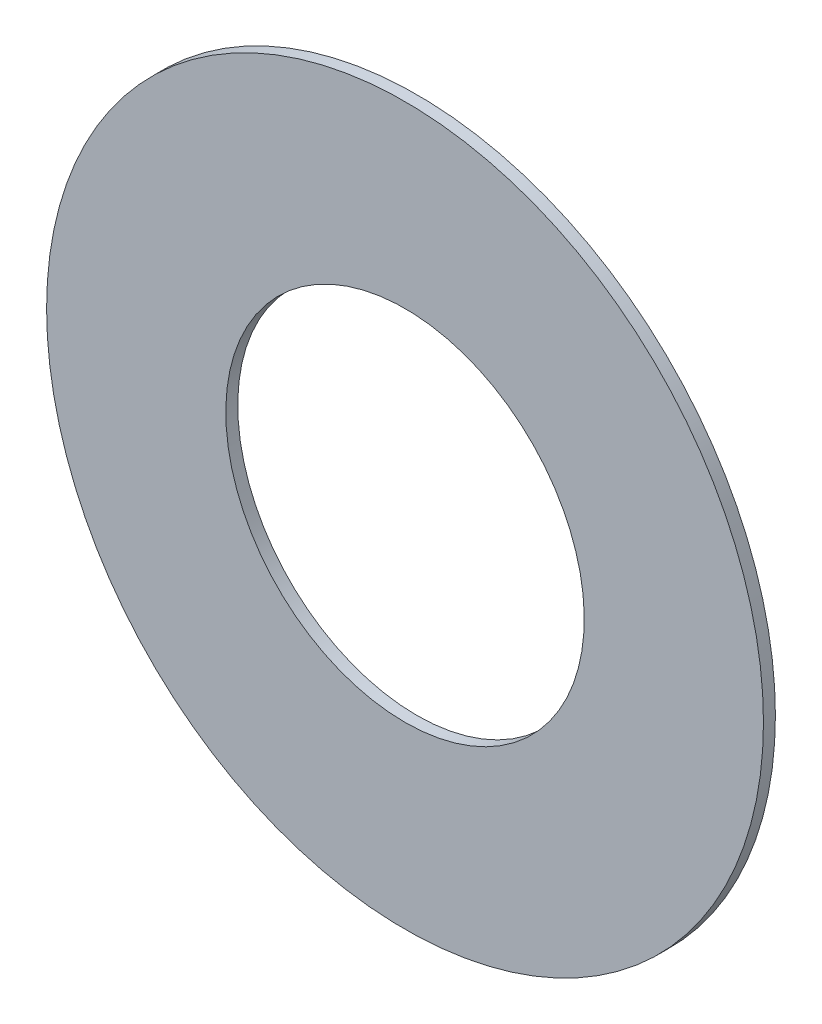
ISO-10303-21;
HEADER;
FILE_DESCRIPTION(('STEP AP214'),'2;1');
FILE_NAME('part.step','',(''),(''),'','','');
FILE_SCHEMA(('AUTOMOTIVE_DESIGN { 1 0 10303 214 1 1 1 1 }'));
ENDSEC;
DATA;
#1=APPLICATION_CONTEXT('core data for automotive mechanical design processes');
#2=APPLICATION_PROTOCOL_DEFINITION('international standard','automotive_design',2000,#1);
#3=PRODUCT_CONTEXT('',#1,'mechanical');
#4=PRODUCT('Part','Part','',(#3));
#5=PRODUCT_RELATED_PRODUCT_CATEGORY('part','',(#4));
#6=PRODUCT_DEFINITION_FORMATION('','',#4);
#7=PRODUCT_DEFINITION_CONTEXT('part definition',#1,'design');
#8=PRODUCT_DEFINITION('design','',#6,#7);
#9=PRODUCT_DEFINITION_SHAPE('','',#8);
#10=(LENGTH_UNIT() NAMED_UNIT(*) SI_UNIT(.MILLI.,.METRE.));
#11=(NAMED_UNIT(*) PLANE_ANGLE_UNIT() SI_UNIT($,.RADIAN.));
#12=(NAMED_UNIT(*) SI_UNIT($,.STERADIAN.) SOLID_ANGLE_UNIT());
#13=UNCERTAINTY_MEASURE_WITH_UNIT(LENGTH_MEASURE(1.E-05),#10,'distance_accuracy_value','');
#14=(GEOMETRIC_REPRESENTATION_CONTEXT(3) GLOBAL_UNCERTAINTY_ASSIGNED_CONTEXT((#13)) GLOBAL_UNIT_ASSIGNED_CONTEXT((#10,
#11,#12)) REPRESENTATION_CONTEXT('',''));
#15=CARTESIAN_POINT('',(0.,0.,0.));
#16=DIRECTION('',(0.,0.,1.));
#17=DIRECTION('',(1.,0.,0.));
#18=AXIS2_PLACEMENT_3D('',#15,#16,#17);
#19=CARTESIAN_POINT('',(134.352,-111.734,-0.045));
#20=DIRECTION('',(0.,0.,-1.));
#21=DIRECTION('',(0.,-1.,0.));
#22=AXIS2_PLACEMENT_3D('',#19,#20,#21);
#23=CYLINDRICAL_SURFACE('',#22,0.525);
#24=CARTESIAN_POINT('',(134.352,-111.734,1.67));
#25=DIRECTION('',(0.,0.,-1.));
#26=DIRECTION('',(0.,-1.,0.));
#27=AXIS2_PLACEMENT_3D('',#24,#25,#26);
#28=CIRCLE('',#27,0.525);
#29=CARTESIAN_POINT('',(134.352,-112.259,1.67));
#30=VERTEX_POINT('',#29);
#31=EDGE_CURVE('E20',#30,#30,#28,.T.);
#32=ORIENTED_EDGE('',*,*,#31,.T.);
#33=DIRECTION('',(0.,0.,1.));
#34=VECTOR('',#33,1.);
#35=CARTESIAN_POINT('',(134.352,-112.259,-0.045));
#36=LINE('',#35,#34);
#37=CARTESIAN_POINT('',(134.352,-112.259,1.705));
#38=VERTEX_POINT('',#37);
#39=EDGE_CURVE('E11',#30,#38,#36,.T.);
#40=ORIENTED_EDGE('',*,*,#39,.T.);
#41=CARTESIAN_POINT('',(134.352,-111.734,1.705));
#42=DIRECTION('',(0.,0.,-1.));
#43=DIRECTION('',(0.,-1.,0.));
#44=AXIS2_PLACEMENT_3D('',#41,#42,#43);
#45=CIRCLE('',#44,0.525);
#46=EDGE_CURVE('E68',#38,#38,#45,.T.);
#47=ORIENTED_EDGE('',*,*,#46,.F.);
#48=ORIENTED_EDGE('',*,*,#39,.F.);
#49=EDGE_LOOP('',(#32,#40,#47,#48));
#50=FACE_BOUND('',#49,.T.);
#51=ADVANCED_FACE('F17',(#50),#23,.F.);
#52=CARTESIAN_POINT('',(134.352,-111.734,1.67));
#53=DIRECTION('',(0.,0.,1.));
#54=DIRECTION('',(1.,0.,0.));
#55=AXIS2_PLACEMENT_3D('',#52,#53,#54);
#56=PLANE('',#55);
#57=ORIENTED_EDGE('',*,*,#31,.F.);
#58=EDGE_LOOP('',(#57));
#59=FACE_BOUND('',#58,.T.);
#60=CARTESIAN_POINT('',(134.352,-111.734,1.67));
#61=DIRECTION('',(0.,0.,1.));
#62=DIRECTION('',(1.,0.,0.));
#63=AXIS2_PLACEMENT_3D('',#60,#61,#62);
#64=CIRCLE('',#63,1.05);
#65=CARTESIAN_POINT('',(135.402,-111.734,1.67));
#66=VERTEX_POINT('',#65);
#67=EDGE_CURVE('E56',#66,#66,#64,.T.);
#68=ORIENTED_EDGE('',*,*,#67,.F.);
#69=EDGE_LOOP('',(#68));
#70=FACE_BOUND('',#69,.T.);
#71=ADVANCED_FACE('F104',(#59,#70),#56,.F.);
#72=CARTESIAN_POINT('',(134.352,-111.734,1.705));
#73=DIRECTION('',(0.,0.,1.));
#74=DIRECTION('',(1.,0.,0.));
#75=AXIS2_PLACEMENT_3D('',#72,#73,#74);
#76=PLANE('',#75);
#77=ORIENTED_EDGE('',*,*,#46,.T.);
#78=EDGE_LOOP('',(#77));
#79=FACE_BOUND('',#78,.T.);
#80=CARTESIAN_POINT('',(134.352,-111.734,1.705));
#81=DIRECTION('',(0.,0.,1.));
#82=DIRECTION('',(1.,0.,0.));
#83=AXIS2_PLACEMENT_3D('',#80,#81,#82);
#84=CIRCLE('',#83,1.05);
#85=CARTESIAN_POINT('',(135.402,-111.734,1.705));
#86=VERTEX_POINT('',#85);
#87=EDGE_CURVE('E54',#86,#86,#84,.T.);
#88=ORIENTED_EDGE('',*,*,#87,.T.);
#89=EDGE_LOOP('',(#88));
#90=FACE_BOUND('',#89,.T.);
#91=ADVANCED_FACE('F60',(#79,#90),#76,.T.);
#92=CARTESIAN_POINT('',(134.352,-111.734,1.67));
#93=DIRECTION('',(0.,0.,1.));
#94=DIRECTION('',(1.,0.,0.));
#95=AXIS2_PLACEMENT_3D('',#92,#93,#94);
#96=CYLINDRICAL_SURFACE('',#95,1.05);
#97=ORIENTED_EDGE('',*,*,#87,.F.);
#98=DIRECTION('',(0.,0.,1.));
#99=VECTOR('',#98,1.);
#100=CARTESIAN_POINT('',(135.402,-111.734,1.67));
#101=LINE('',#100,#99);
#102=EDGE_CURVE('E51',#66,#86,#101,.T.);
#103=ORIENTED_EDGE('',*,*,#102,.F.);
#104=ORIENTED_EDGE('',*,*,#67,.T.);
#105=ORIENTED_EDGE('',*,*,#102,.T.);
#106=EDGE_LOOP('',(#97,#103,#104,#105));
#107=FACE_BOUND('',#106,.T.);
#108=ADVANCED_FACE('F53',(#107),#96,.T.);
#109=CLOSED_SHELL('',(#51,#71,#91,#108));
#110=MANIFOLD_SOLID_BREP('B1',#109);
#111=ADVANCED_BREP_SHAPE_REPRESENTATION('',(#18,#110),#14);
#112=SHAPE_DEFINITION_REPRESENTATION(#9,#111);
ENDSEC;
END-ISO-10303-21;
